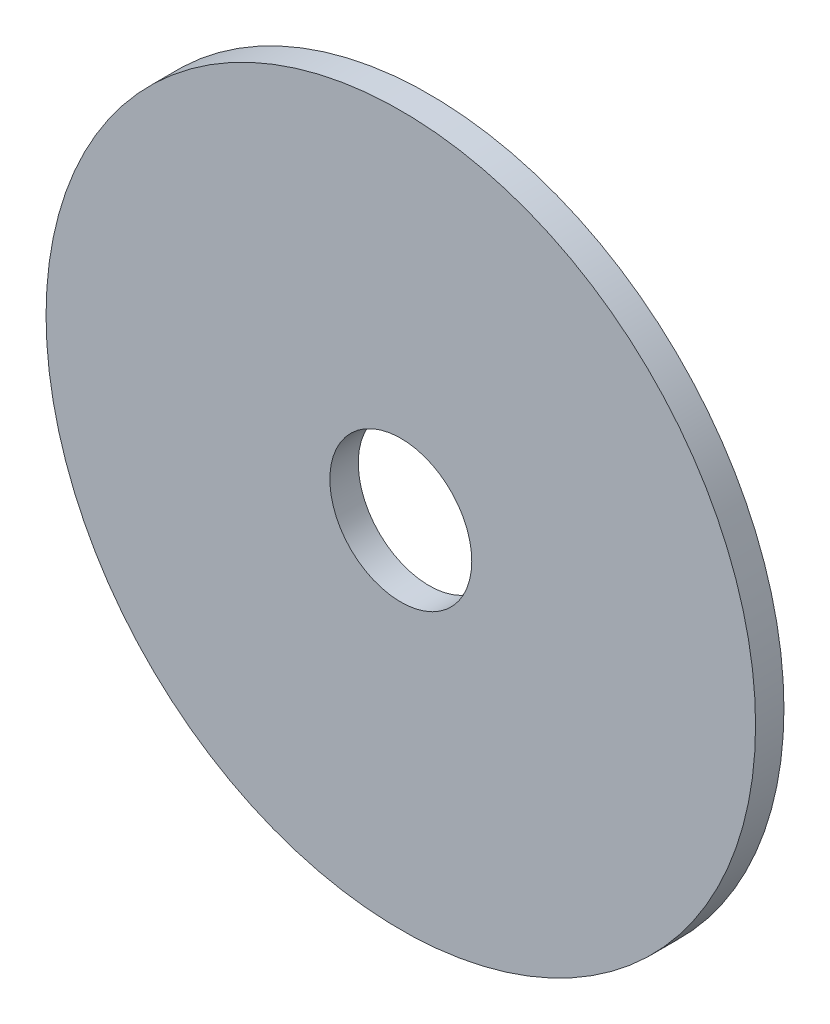
ISO-10303-21;
HEADER;
FILE_DESCRIPTION(('STEP AP214'),'2;1');
FILE_NAME('part.step','',(''),(''),'','','');
FILE_SCHEMA(('AUTOMOTIVE_DESIGN { 1 0 10303 214 1 1 1 1 }'));
ENDSEC;
DATA;
#1=APPLICATION_CONTEXT('core data for automotive mechanical design processes');
#2=APPLICATION_PROTOCOL_DEFINITION('international standard','automotive_design',2000,#1);
#3=PRODUCT_CONTEXT('',#1,'mechanical');
#4=PRODUCT('Part','Part','',(#3));
#5=PRODUCT_RELATED_PRODUCT_CATEGORY('part','',(#4));
#6=PRODUCT_DEFINITION_FORMATION('','',#4);
#7=PRODUCT_DEFINITION_CONTEXT('part definition',#1,'design');
#8=PRODUCT_DEFINITION('design','',#6,#7);
#9=PRODUCT_DEFINITION_SHAPE('','',#8);
#10=(LENGTH_UNIT() NAMED_UNIT(*) SI_UNIT(.MILLI.,.METRE.));
#11=(NAMED_UNIT(*) PLANE_ANGLE_UNIT() SI_UNIT($,.RADIAN.));
#12=(NAMED_UNIT(*) SI_UNIT($,.STERADIAN.) SOLID_ANGLE_UNIT());
#13=UNCERTAINTY_MEASURE_WITH_UNIT(LENGTH_MEASURE(1.E-05),#10,'distance_accuracy_value','');
#14=(GEOMETRIC_REPRESENTATION_CONTEXT(3) GLOBAL_UNCERTAINTY_ASSIGNED_CONTEXT((#13)) GLOBAL_UNIT_ASSIGNED_CONTEXT((#10,
#11,#12)) REPRESENTATION_CONTEXT('',''));
#15=CARTESIAN_POINT('',(0.,0.,0.));
#16=DIRECTION('',(0.,0.,1.));
#17=DIRECTION('',(1.,0.,0.));
#18=AXIS2_PLACEMENT_3D('',#15,#16,#17);
#19=CARTESIAN_POINT('',(0.,0.,0.635));
#20=DIRECTION('',(0.,0.,1.));
#21=DIRECTION('',(1.,0.,0.));
#22=AXIS2_PLACEMENT_3D('',#19,#20,#21);
#23=PLANE('',#22);
#24=CARTESIAN_POINT('',(0.,0.,0.635));
#25=DIRECTION('',(0.,0.,1.));
#26=DIRECTION('',(1.,0.,0.));
#27=AXIS2_PLACEMENT_3D('',#24,#25,#26);
#28=CIRCLE('',#27,7.9375);
#29=CARTESIAN_POINT('',(7.9375,0.,0.635));
#30=VERTEX_POINT('',#29);
#31=EDGE_CURVE('E10',#30,#30,#28,.T.);
#32=ORIENTED_EDGE('',*,*,#31,.T.);
#33=EDGE_LOOP('',(#32));
#34=FACE_BOUND('',#33,.T.);
#35=CARTESIAN_POINT('',(0.,0.,0.635));
#36=DIRECTION('',(0.,0.,1.));
#37=DIRECTION('',(1.,0.,0.));
#38=AXIS2_PLACEMENT_3D('',#35,#36,#37);
#39=CIRCLE('',#38,1.5875);
#40=CARTESIAN_POINT('',(1.5875,0.,0.635));
#41=VERTEX_POINT('',#40);
#42=EDGE_CURVE('E41',#41,#41,#39,.T.);
#43=ORIENTED_EDGE('',*,*,#42,.F.);
#44=EDGE_LOOP('',(#43));
#45=FACE_BOUND('',#44,.T.);
#46=ADVANCED_FACE('F30',(#34,#45),#23,.T.);
#47=CARTESIAN_POINT('',(0.,0.,0.));
#48=DIRECTION('',(0.,0.,1.));
#49=DIRECTION('',(1.,0.,0.));
#50=AXIS2_PLACEMENT_3D('',#47,#48,#49);
#51=PLANE('',#50);
#52=CARTESIAN_POINT('',(0.,0.,0.));
#53=DIRECTION('',(0.,0.,1.));
#54=DIRECTION('',(1.,0.,0.));
#55=AXIS2_PLACEMENT_3D('',#52,#53,#54);
#56=CIRCLE('',#55,7.9375);
#57=CARTESIAN_POINT('',(7.9375,0.,0.));
#58=VERTEX_POINT('',#57);
#59=EDGE_CURVE('E34',#58,#58,#56,.T.);
#60=ORIENTED_EDGE('',*,*,#59,.F.);
#61=EDGE_LOOP('',(#60));
#62=FACE_BOUND('',#61,.T.);
#63=CARTESIAN_POINT('',(0.,0.,0.));
#64=DIRECTION('',(0.,0.,1.));
#65=DIRECTION('',(1.,0.,0.));
#66=AXIS2_PLACEMENT_3D('',#63,#64,#65);
#67=CIRCLE('',#66,1.5875);
#68=CARTESIAN_POINT('',(1.5875,0.,0.));
#69=VERTEX_POINT('',#68);
#70=EDGE_CURVE('E43',#69,#69,#67,.T.);
#71=ORIENTED_EDGE('',*,*,#70,.T.);
#72=EDGE_LOOP('',(#71));
#73=FACE_BOUND('',#72,.T.);
#74=ADVANCED_FACE('F53',(#62,#73),#51,.F.);
#75=CARTESIAN_POINT('',(0.,0.,0.635));
#76=DIRECTION('',(0.,0.,-1.));
#77=DIRECTION('',(-1.,0.,0.));
#78=AXIS2_PLACEMENT_3D('',#75,#76,#77);
#79=CYLINDRICAL_SURFACE('',#78,7.9375);
#80=ORIENTED_EDGE('',*,*,#31,.F.);
#81=EDGE_LOOP('',(#80));
#82=FACE_BOUND('',#81,.T.);
#83=ORIENTED_EDGE('',*,*,#59,.T.);
#84=EDGE_LOOP('',(#83));
#85=FACE_BOUND('',#84,.T.);
#86=ADVANCED_FACE('F32',(#82,#85),#79,.T.);
#87=CARTESIAN_POINT('',(0.,0.,0.635));
#88=DIRECTION('',(0.,0.,-1.));
#89=DIRECTION('',(-1.,0.,0.));
#90=AXIS2_PLACEMENT_3D('',#87,#88,#89);
#91=CYLINDRICAL_SURFACE('',#90,1.5875);
#92=ORIENTED_EDGE('',*,*,#42,.T.);
#93=EDGE_LOOP('',(#92));
#94=FACE_BOUND('',#93,.T.);
#95=ORIENTED_EDGE('',*,*,#70,.F.);
#96=EDGE_LOOP('',(#95));
#97=FACE_BOUND('',#96,.T.);
#98=ADVANCED_FACE('F49',(#94,#97),#91,.F.);
#99=CLOSED_SHELL('',(#46,#74,#86,#98));
#100=MANIFOLD_SOLID_BREP('B2',#99);
#101=ADVANCED_BREP_SHAPE_REPRESENTATION('',(#18,#100),#14);
#102=SHAPE_DEFINITION_REPRESENTATION(#9,#101);
ENDSEC;
END-ISO-10303-21;
